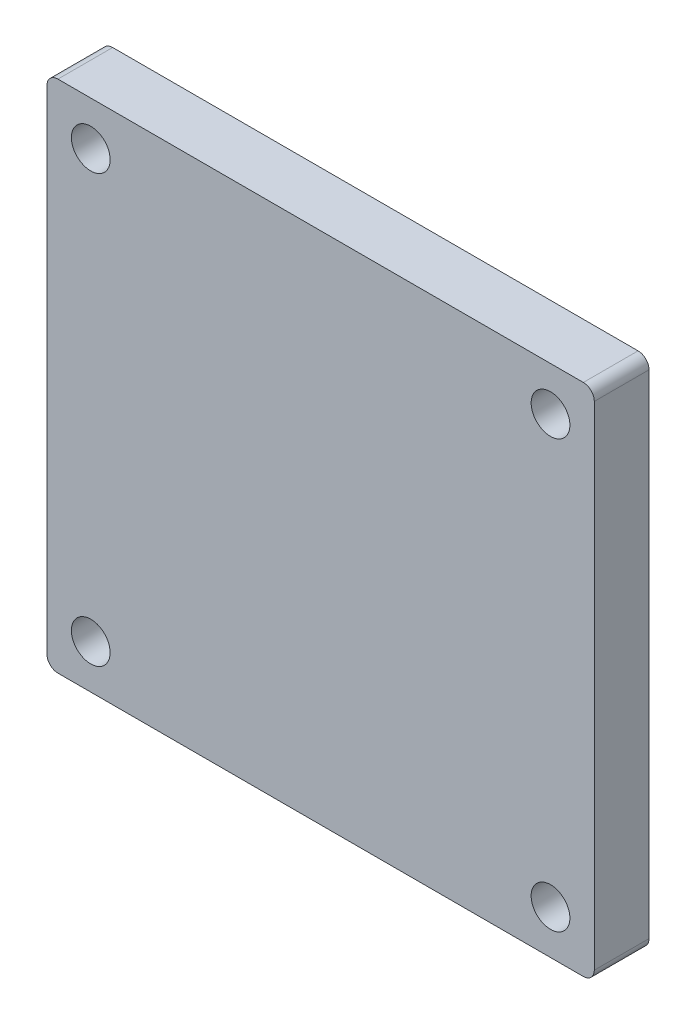
ISO-10303-21;
HEADER;
FILE_DESCRIPTION(('STEP AP214'),'2;1');
FILE_NAME('part.step','',(''),(''),'','','');
FILE_SCHEMA(('AUTOMOTIVE_DESIGN { 1 0 10303 214 1 1 1 1 }'));
ENDSEC;
DATA;
#1=APPLICATION_CONTEXT('core data for automotive mechanical design processes');
#2=APPLICATION_PROTOCOL_DEFINITION('international standard','automotive_design',2000,#1);
#3=PRODUCT_CONTEXT('',#1,'mechanical');
#4=PRODUCT('Part','Part','',(#3));
#5=PRODUCT_RELATED_PRODUCT_CATEGORY('part','',(#4));
#6=PRODUCT_DEFINITION_FORMATION('','',#4);
#7=PRODUCT_DEFINITION_CONTEXT('part definition',#1,'design');
#8=PRODUCT_DEFINITION('design','',#6,#7);
#9=PRODUCT_DEFINITION_SHAPE('','',#8);
#10=(LENGTH_UNIT() NAMED_UNIT(*) SI_UNIT(.MILLI.,.METRE.));
#11=(NAMED_UNIT(*) PLANE_ANGLE_UNIT() SI_UNIT($,.RADIAN.));
#12=(NAMED_UNIT(*) SI_UNIT($,.STERADIAN.) SOLID_ANGLE_UNIT());
#13=UNCERTAINTY_MEASURE_WITH_UNIT(LENGTH_MEASURE(1.E-05),#10,'distance_accuracy_value','');
#14=(GEOMETRIC_REPRESENTATION_CONTEXT(3) GLOBAL_UNCERTAINTY_ASSIGNED_CONTEXT((#13)) GLOBAL_UNIT_ASSIGNED_CONTEXT((#10,
#11,#12)) REPRESENTATION_CONTEXT('',''));
#15=CARTESIAN_POINT('',(0.,0.,0.));
#16=DIRECTION('',(0.,0.,1.));
#17=DIRECTION('',(1.,0.,0.));
#18=AXIS2_PLACEMENT_3D('',#15,#16,#17);
#19=CARTESIAN_POINT('',(0.,0.,6.35));
#20=DIRECTION('',(1.,0.,0.));
#21=DIRECTION('',(0.,0.,-1.));
#22=AXIS2_PLACEMENT_3D('',#19,#20,#21);
#23=PLANE('',#22);
#24=DIRECTION('',(0.,-1.,0.));
#25=VECTOR('',#24,1.);
#26=CARTESIAN_POINT('',(0.,0.,0.));
#27=LINE('',#26,#25);
#28=CARTESIAN_POINT('',(0.,58.42,0.));
#29=VERTEX_POINT('',#28);
#30=CARTESIAN_POINT('',(0.,1.27,0.));
#31=VERTEX_POINT('',#30);
#32=EDGE_CURVE('E130',#29,#31,#27,.T.);
#33=ORIENTED_EDGE('',*,*,#32,.T.);
#34=DIRECTION('',(0.,0.,-1.));
#35=VECTOR('',#34,1.);
#36=CARTESIAN_POINT('',(0.,1.27,6.35));
#37=LINE('',#36,#35);
#38=CARTESIAN_POINT('',(0.,1.27,6.35));
#39=VERTEX_POINT('',#38);
#40=EDGE_CURVE('E108',#31,#39,#37,.F.);
#41=ORIENTED_EDGE('',*,*,#40,.T.);
#42=DIRECTION('',(0.,-1.,0.));
#43=VECTOR('',#42,1.);
#44=CARTESIAN_POINT('',(0.,0.,6.35));
#45=LINE('',#44,#43);
#46=CARTESIAN_POINT('',(0.,58.42,6.35));
#47=VERTEX_POINT('',#46);
#48=EDGE_CURVE('E139',#47,#39,#45,.T.);
#49=ORIENTED_EDGE('',*,*,#48,.F.);
#50=DIRECTION('',(0.,0.,-1.));
#51=VECTOR('',#50,1.);
#52=CARTESIAN_POINT('',(0.,58.42,6.35));
#53=LINE('',#52,#51);
#54=EDGE_CURVE('E113',#47,#29,#53,.T.);
#55=ORIENTED_EDGE('',*,*,#54,.T.);
#56=EDGE_LOOP('',(#33,#41,#49,#55));
#57=FACE_BOUND('',#56,.T.);
#58=ADVANCED_FACE('F37',(#57),#23,.F.);
#59=CARTESIAN_POINT('',(0.,0.,6.35));
#60=DIRECTION('',(0.,1.,0.));
#61=DIRECTION('',(0.,0.,1.));
#62=AXIS2_PLACEMENT_3D('',#59,#60,#61);
#63=PLANE('',#62);
#64=DIRECTION('',(1.,0.,0.));
#65=VECTOR('',#64,1.);
#66=CARTESIAN_POINT('',(0.,0.,6.35));
#67=LINE('',#66,#65);
#68=CARTESIAN_POINT('',(1.27,0.,6.35));
#69=VERTEX_POINT('',#68);
#70=CARTESIAN_POINT('',(62.23,0.,6.35));
#71=VERTEX_POINT('',#70);
#72=EDGE_CURVE('E123',#69,#71,#67,.T.);
#73=ORIENTED_EDGE('',*,*,#72,.F.);
#74=DIRECTION('',(0.,0.,-1.));
#75=VECTOR('',#74,1.);
#76=CARTESIAN_POINT('',(1.27,0.,6.35));
#77=LINE('',#76,#75);
#78=CARTESIAN_POINT('',(1.27,0.,0.));
#79=VERTEX_POINT('',#78);
#80=EDGE_CURVE('E107',#69,#79,#77,.T.);
#81=ORIENTED_EDGE('',*,*,#80,.T.);
#82=DIRECTION('',(1.,0.,0.));
#83=VECTOR('',#82,1.);
#84=CARTESIAN_POINT('',(0.,0.,0.));
#85=LINE('',#84,#83);
#86=CARTESIAN_POINT('',(62.23,0.,0.));
#87=VERTEX_POINT('',#86);
#88=EDGE_CURVE('E120',#79,#87,#85,.T.);
#89=ORIENTED_EDGE('',*,*,#88,.T.);
#90=DIRECTION('',(0.,0.,-1.));
#91=VECTOR('',#90,1.);
#92=CARTESIAN_POINT('',(62.23,0.,6.35));
#93=LINE('',#92,#91);
#94=EDGE_CURVE('E125',#87,#71,#93,.F.);
#95=ORIENTED_EDGE('',*,*,#94,.T.);
#96=EDGE_LOOP('',(#73,#81,#89,#95));
#97=FACE_BOUND('',#96,.T.);
#98=ADVANCED_FACE('F119',(#97),#63,.F.);
#99=CARTESIAN_POINT('',(63.5,0.,6.35));
#100=DIRECTION('',(-1.,0.,0.));
#101=DIRECTION('',(0.,0.,1.));
#102=AXIS2_PLACEMENT_3D('',#99,#100,#101);
#103=PLANE('',#102);
#104=DIRECTION('',(0.,1.,0.));
#105=VECTOR('',#104,1.);
#106=CARTESIAN_POINT('',(63.5,0.,6.35));
#107=LINE('',#106,#105);
#108=CARTESIAN_POINT('',(63.5,1.27,6.35));
#109=VERTEX_POINT('',#108);
#110=CARTESIAN_POINT('',(63.5,58.42,6.35));
#111=VERTEX_POINT('',#110);
#112=EDGE_CURVE('E169',#109,#111,#107,.T.);
#113=ORIENTED_EDGE('',*,*,#112,.F.);
#114=DIRECTION('',(0.,0.,-1.));
#115=VECTOR('',#114,1.);
#116=CARTESIAN_POINT('',(63.5,1.27,6.35));
#117=LINE('',#116,#115);
#118=CARTESIAN_POINT('',(63.5,1.27,0.));
#119=VERTEX_POINT('',#118);
#120=EDGE_CURVE('E162',#109,#119,#117,.T.);
#121=ORIENTED_EDGE('',*,*,#120,.T.);
#122=DIRECTION('',(0.,1.,0.));
#123=VECTOR('',#122,1.);
#124=CARTESIAN_POINT('',(63.5,0.,0.));
#125=LINE('',#124,#123);
#126=CARTESIAN_POINT('',(63.5,58.42,0.));
#127=VERTEX_POINT('',#126);
#128=EDGE_CURVE('E129',#119,#127,#125,.T.);
#129=ORIENTED_EDGE('',*,*,#128,.T.);
#130=DIRECTION('',(0.,0.,-1.));
#131=VECTOR('',#130,1.);
#132=CARTESIAN_POINT('',(63.5,58.42,6.35));
#133=LINE('',#132,#131);
#134=EDGE_CURVE('E160',#127,#111,#133,.F.);
#135=ORIENTED_EDGE('',*,*,#134,.T.);
#136=EDGE_LOOP('',(#113,#121,#129,#135));
#137=FACE_BOUND('',#136,.T.);
#138=ADVANCED_FACE('F167',(#137),#103,.F.);
#139=CARTESIAN_POINT('',(0.,59.69,6.35));
#140=DIRECTION('',(0.,-1.,0.));
#141=DIRECTION('',(0.,0.,-1.));
#142=AXIS2_PLACEMENT_3D('',#139,#140,#141);
#143=PLANE('',#142);
#144=DIRECTION('',(-1.,0.,0.));
#145=VECTOR('',#144,1.);
#146=CARTESIAN_POINT('',(0.,59.69,6.35));
#147=LINE('',#146,#145);
#148=CARTESIAN_POINT('',(62.23,59.69,6.35));
#149=VERTEX_POINT('',#148);
#150=CARTESIAN_POINT('',(1.27,59.69,6.35));
#151=VERTEX_POINT('',#150);
#152=EDGE_CURVE('E140',#149,#151,#147,.T.);
#153=ORIENTED_EDGE('',*,*,#152,.F.);
#154=DIRECTION('',(0.,0.,-1.));
#155=VECTOR('',#154,1.);
#156=CARTESIAN_POINT('',(62.23,59.69,6.35));
#157=LINE('',#156,#155);
#158=CARTESIAN_POINT('',(62.23,59.69,0.));
#159=VERTEX_POINT('',#158);
#160=EDGE_CURVE('E12',#149,#159,#157,.T.);
#161=ORIENTED_EDGE('',*,*,#160,.T.);
#162=DIRECTION('',(-1.,0.,0.));
#163=VECTOR('',#162,1.);
#164=CARTESIAN_POINT('',(0.,59.69,0.));
#165=LINE('',#164,#163);
#166=CARTESIAN_POINT('',(1.27,59.69,0.));
#167=VERTEX_POINT('',#166);
#168=EDGE_CURVE('E133',#159,#167,#165,.T.);
#169=ORIENTED_EDGE('',*,*,#168,.T.);
#170=DIRECTION('',(0.,0.,-1.));
#171=VECTOR('',#170,1.);
#172=CARTESIAN_POINT('',(1.27,59.69,6.35));
#173=LINE('',#172,#171);
#174=EDGE_CURVE('E45',#167,#151,#173,.F.);
#175=ORIENTED_EDGE('',*,*,#174,.T.);
#176=EDGE_LOOP('',(#153,#161,#169,#175));
#177=FACE_BOUND('',#176,.T.);
#178=ADVANCED_FACE('F176',(#177),#143,.F.);
#179=CARTESIAN_POINT('',(0.,0.,6.35));
#180=DIRECTION('',(0.,0.,-1.));
#181=DIRECTION('',(-1.,0.,0.));
#182=AXIS2_PLACEMENT_3D('',#179,#180,#181);
#183=PLANE('',#182);
#184=CARTESIAN_POINT('',(5.08,54.61,6.35));
#185=DIRECTION('',(0.,0.,1.));
#186=DIRECTION('',(1.,0.,0.));
#187=AXIS2_PLACEMENT_3D('',#184,#185,#186);
#188=CIRCLE('',#187,2.24789999999999);
#189=CARTESIAN_POINT('',(7.32789999999999,54.61,6.35));
#190=VERTEX_POINT('',#189);
#191=EDGE_CURVE('E221',#190,#190,#188,.T.);
#192=ORIENTED_EDGE('',*,*,#191,.F.);
#193=EDGE_LOOP('',(#192));
#194=FACE_BOUND('',#193,.T.);
#195=CARTESIAN_POINT('',(58.42,54.61,6.35));
#196=DIRECTION('',(0.,0.,1.));
#197=DIRECTION('',(1.,0.,0.));
#198=AXIS2_PLACEMENT_3D('',#195,#196,#197);
#199=CIRCLE('',#198,2.24789999999998);
#200=CARTESIAN_POINT('',(60.6679,54.61,6.35));
#201=VERTEX_POINT('',#200);
#202=EDGE_CURVE('E214',#201,#201,#199,.T.);
#203=ORIENTED_EDGE('',*,*,#202,.F.);
#204=EDGE_LOOP('',(#203));
#205=FACE_BOUND('',#204,.T.);
#206=CARTESIAN_POINT('',(58.42,5.08,6.35));
#207=DIRECTION('',(0.,0.,1.));
#208=DIRECTION('',(1.,0.,0.));
#209=AXIS2_PLACEMENT_3D('',#206,#207,#208);
#210=CIRCLE('',#209,2.24789999999998);
#211=CARTESIAN_POINT('',(60.6679,5.08,6.35));
#212=VERTEX_POINT('',#211);
#213=EDGE_CURVE('E204',#212,#212,#210,.T.);
#214=ORIENTED_EDGE('',*,*,#213,.F.);
#215=EDGE_LOOP('',(#214));
#216=FACE_BOUND('',#215,.T.);
#217=CARTESIAN_POINT('',(5.08,5.08,6.35));
#218=DIRECTION('',(0.,0.,1.));
#219=DIRECTION('',(1.,0.,0.));
#220=AXIS2_PLACEMENT_3D('',#217,#218,#219);
#221=CIRCLE('',#220,2.24789999999999);
#222=CARTESIAN_POINT('',(7.32789999999999,5.08,6.35));
#223=VERTEX_POINT('',#222);
#224=EDGE_CURVE('E196',#223,#223,#221,.T.);
#225=ORIENTED_EDGE('',*,*,#224,.F.);
#226=EDGE_LOOP('',(#225));
#227=FACE_BOUND('',#226,.T.);
#228=ORIENTED_EDGE('',*,*,#48,.T.);
#229=CARTESIAN_POINT('',(1.27,1.27,6.35));
#230=DIRECTION('',(0.,0.,-1.));
#231=DIRECTION('',(-1.,0.,0.));
#232=AXIS2_PLACEMENT_3D('',#229,#230,#231);
#233=CIRCLE('',#232,1.27);
#234=EDGE_CURVE('E157',#39,#69,#233,.F.);
#235=ORIENTED_EDGE('',*,*,#234,.T.);
#236=ORIENTED_EDGE('',*,*,#72,.T.);
#237=CARTESIAN_POINT('',(62.23,1.27,6.35));
#238=DIRECTION('',(0.,0.,-1.));
#239=DIRECTION('',(-1.,0.,0.));
#240=AXIS2_PLACEMENT_3D('',#237,#238,#239);
#241=CIRCLE('',#240,1.27);
#242=EDGE_CURVE('E154',#71,#109,#241,.F.);
#243=ORIENTED_EDGE('',*,*,#242,.T.);
#244=ORIENTED_EDGE('',*,*,#112,.T.);
#245=CARTESIAN_POINT('',(62.23,58.42,6.35));
#246=DIRECTION('',(0.,0.,-1.));
#247=DIRECTION('',(-1.,0.,0.));
#248=AXIS2_PLACEMENT_3D('',#245,#246,#247);
#249=CIRCLE('',#248,1.27);
#250=EDGE_CURVE('E58',#111,#149,#249,.F.);
#251=ORIENTED_EDGE('',*,*,#250,.T.);
#252=ORIENTED_EDGE('',*,*,#152,.T.);
#253=CARTESIAN_POINT('',(1.27,58.42,6.35));
#254=DIRECTION('',(0.,0.,-1.));
#255=DIRECTION('',(-1.,0.,0.));
#256=AXIS2_PLACEMENT_3D('',#253,#254,#255);
#257=CIRCLE('',#256,1.27);
#258=EDGE_CURVE('E149',#151,#47,#257,.F.);
#259=ORIENTED_EDGE('',*,*,#258,.T.);
#260=EDGE_LOOP('',(#228,#235,#236,#243,#244,#251,#252,#259));
#261=FACE_BOUND('',#260,.T.);
#262=ADVANCED_FACE('F229',(#194,#205,#216,#227,#261),#183,.F.);
#263=CARTESIAN_POINT('',(0.,0.,0.));
#264=DIRECTION('',(0.,0.,-1.));
#265=DIRECTION('',(-1.,0.,0.));
#266=AXIS2_PLACEMENT_3D('',#263,#264,#265);
#267=PLANE('',#266);
#268=CARTESIAN_POINT('',(5.08,54.61,0.));
#269=DIRECTION('',(0.,0.,1.));
#270=DIRECTION('',(1.,0.,0.));
#271=AXIS2_PLACEMENT_3D('',#268,#269,#270);
#272=CIRCLE('',#271,2.2479);
#273=CARTESIAN_POINT('',(7.3279,54.61,0.));
#274=VERTEX_POINT('',#273);
#275=EDGE_CURVE('E219',#274,#274,#272,.T.);
#276=ORIENTED_EDGE('',*,*,#275,.T.);
#277=EDGE_LOOP('',(#276));
#278=FACE_BOUND('',#277,.T.);
#279=CARTESIAN_POINT('',(58.42,54.61,0.));
#280=DIRECTION('',(0.,0.,1.));
#281=DIRECTION('',(1.,0.,0.));
#282=AXIS2_PLACEMENT_3D('',#279,#280,#281);
#283=CIRCLE('',#282,2.2479);
#284=CARTESIAN_POINT('',(60.6679,54.61,0.));
#285=VERTEX_POINT('',#284);
#286=EDGE_CURVE('E209',#285,#285,#283,.T.);
#287=ORIENTED_EDGE('',*,*,#286,.T.);
#288=EDGE_LOOP('',(#287));
#289=FACE_BOUND('',#288,.T.);
#290=CARTESIAN_POINT('',(58.42,5.08,0.));
#291=DIRECTION('',(0.,0.,1.));
#292=DIRECTION('',(1.,0.,0.));
#293=AXIS2_PLACEMENT_3D('',#290,#291,#292);
#294=CIRCLE('',#293,2.2479);
#295=CARTESIAN_POINT('',(60.6679,5.08,0.));
#296=VERTEX_POINT('',#295);
#297=EDGE_CURVE('E201',#296,#296,#294,.T.);
#298=ORIENTED_EDGE('',*,*,#297,.T.);
#299=EDGE_LOOP('',(#298));
#300=FACE_BOUND('',#299,.T.);
#301=CARTESIAN_POINT('',(5.08,5.08,0.));
#302=DIRECTION('',(0.,0.,1.));
#303=DIRECTION('',(1.,0.,0.));
#304=AXIS2_PLACEMENT_3D('',#301,#302,#303);
#305=CIRCLE('',#304,2.2479);
#306=CARTESIAN_POINT('',(7.3279,5.08,0.));
#307=VERTEX_POINT('',#306);
#308=EDGE_CURVE('E135',#307,#307,#305,.T.);
#309=ORIENTED_EDGE('',*,*,#308,.T.);
#310=EDGE_LOOP('',(#309));
#311=FACE_BOUND('',#310,.T.);
#312=ORIENTED_EDGE('',*,*,#88,.F.);
#313=CARTESIAN_POINT('',(1.27,1.27,0.));
#314=DIRECTION('',(0.,0.,-1.));
#315=DIRECTION('',(-1.,0.,0.));
#316=AXIS2_PLACEMENT_3D('',#313,#314,#315);
#317=CIRCLE('',#316,1.27);
#318=EDGE_CURVE('E103',#79,#31,#317,.T.);
#319=ORIENTED_EDGE('',*,*,#318,.T.);
#320=ORIENTED_EDGE('',*,*,#32,.F.);
#321=CARTESIAN_POINT('',(1.27,58.42,0.));
#322=DIRECTION('',(0.,0.,-1.));
#323=DIRECTION('',(-1.,0.,0.));
#324=AXIS2_PLACEMENT_3D('',#321,#322,#323);
#325=CIRCLE('',#324,1.27);
#326=EDGE_CURVE('E124',#29,#167,#325,.T.);
#327=ORIENTED_EDGE('',*,*,#326,.T.);
#328=ORIENTED_EDGE('',*,*,#168,.F.);
#329=CARTESIAN_POINT('',(62.23,58.42,0.));
#330=DIRECTION('',(0.,0.,-1.));
#331=DIRECTION('',(-1.,0.,0.));
#332=AXIS2_PLACEMENT_3D('',#329,#330,#331);
#333=CIRCLE('',#332,1.27);
#334=EDGE_CURVE('E143',#159,#127,#333,.T.);
#335=ORIENTED_EDGE('',*,*,#334,.T.);
#336=ORIENTED_EDGE('',*,*,#128,.F.);
#337=CARTESIAN_POINT('',(62.23,1.27,0.));
#338=DIRECTION('',(0.,0.,-1.));
#339=DIRECTION('',(-1.,0.,0.));
#340=AXIS2_PLACEMENT_3D('',#337,#338,#339);
#341=CIRCLE('',#340,1.27);
#342=EDGE_CURVE('E114',#119,#87,#341,.T.);
#343=ORIENTED_EDGE('',*,*,#342,.T.);
#344=EDGE_LOOP('',(#312,#319,#320,#327,#328,#335,#336,#343));
#345=FACE_BOUND('',#344,.T.);
#346=ADVANCED_FACE('F127',(#278,#289,#300,#311,#345),#267,.T.);
#347=CARTESIAN_POINT('',(1.27,1.27,6.35));
#348=DIRECTION('',(0.,0.,-1.));
#349=DIRECTION('',(-1.,0.,0.));
#350=AXIS2_PLACEMENT_3D('',#347,#348,#349);
#351=CYLINDRICAL_SURFACE('',#350,1.27);
#352=ORIENTED_EDGE('',*,*,#234,.F.);
#353=ORIENTED_EDGE('',*,*,#40,.F.);
#354=ORIENTED_EDGE('',*,*,#318,.F.);
#355=ORIENTED_EDGE('',*,*,#80,.F.);
#356=EDGE_LOOP('',(#352,#353,#354,#355));
#357=FACE_BOUND('',#356,.T.);
#358=ADVANCED_FACE('F106',(#357),#351,.T.);
#359=CARTESIAN_POINT('',(62.23,1.27,6.35));
#360=DIRECTION('',(0.,0.,-1.));
#361=DIRECTION('',(-1.,0.,0.));
#362=AXIS2_PLACEMENT_3D('',#359,#360,#361);
#363=CYLINDRICAL_SURFACE('',#362,1.27);
#364=ORIENTED_EDGE('',*,*,#242,.F.);
#365=ORIENTED_EDGE('',*,*,#94,.F.);
#366=ORIENTED_EDGE('',*,*,#342,.F.);
#367=ORIENTED_EDGE('',*,*,#120,.F.);
#368=EDGE_LOOP('',(#364,#365,#366,#367));
#369=FACE_BOUND('',#368,.T.);
#370=ADVANCED_FACE('F251',(#369),#363,.T.);
#371=CARTESIAN_POINT('',(62.23,58.42,6.35));
#372=DIRECTION('',(0.,0.,-1.));
#373=DIRECTION('',(-1.,0.,0.));
#374=AXIS2_PLACEMENT_3D('',#371,#372,#373);
#375=CYLINDRICAL_SURFACE('',#374,1.27);
#376=ORIENTED_EDGE('',*,*,#250,.F.);
#377=ORIENTED_EDGE('',*,*,#134,.F.);
#378=ORIENTED_EDGE('',*,*,#334,.F.);
#379=ORIENTED_EDGE('',*,*,#160,.F.);
#380=EDGE_LOOP('',(#376,#377,#378,#379));
#381=FACE_BOUND('',#380,.T.);
#382=ADVANCED_FACE('F175',(#381),#375,.T.);
#383=CARTESIAN_POINT('',(1.27,58.42,6.35));
#384=DIRECTION('',(0.,0.,-1.));
#385=DIRECTION('',(-1.,0.,0.));
#386=AXIS2_PLACEMENT_3D('',#383,#384,#385);
#387=CYLINDRICAL_SURFACE('',#386,1.27);
#388=ORIENTED_EDGE('',*,*,#258,.F.);
#389=ORIENTED_EDGE('',*,*,#174,.F.);
#390=ORIENTED_EDGE('',*,*,#326,.F.);
#391=ORIENTED_EDGE('',*,*,#54,.F.);
#392=EDGE_LOOP('',(#388,#389,#390,#391));
#393=FACE_BOUND('',#392,.T.);
#394=ADVANCED_FACE('F39',(#393),#387,.T.);
#395=CARTESIAN_POINT('',(5.08,5.08,6.35));
#396=DIRECTION('',(0.,0.,1.));
#397=DIRECTION('',(1.,0.,0.));
#398=AXIS2_PLACEMENT_3D('',#395,#396,#397);
#399=CYLINDRICAL_SURFACE('',#398,2.24789999999999);
#400=ORIENTED_EDGE('',*,*,#308,.F.);
#401=EDGE_LOOP('',(#400));
#402=FACE_BOUND('',#401,.T.);
#403=ORIENTED_EDGE('',*,*,#224,.T.);
#404=EDGE_LOOP('',(#403));
#405=FACE_BOUND('',#404,.T.);
#406=ADVANCED_FACE('F243',(#402,#405),#399,.F.);
#407=CARTESIAN_POINT('',(58.42,5.08,6.35));
#408=DIRECTION('',(0.,0.,1.));
#409=DIRECTION('',(1.,0.,0.));
#410=AXIS2_PLACEMENT_3D('',#407,#408,#409);
#411=CYLINDRICAL_SURFACE('',#410,2.24789999999999);
#412=ORIENTED_EDGE('',*,*,#297,.F.);
#413=EDGE_LOOP('',(#412));
#414=FACE_BOUND('',#413,.T.);
#415=ORIENTED_EDGE('',*,*,#213,.T.);
#416=EDGE_LOOP('',(#415));
#417=FACE_BOUND('',#416,.T.);
#418=ADVANCED_FACE('F248',(#414,#417),#411,.F.);
#419=CARTESIAN_POINT('',(58.42,54.61,6.35));
#420=DIRECTION('',(0.,0.,1.));
#421=DIRECTION('',(1.,0.,0.));
#422=AXIS2_PLACEMENT_3D('',#419,#420,#421);
#423=CYLINDRICAL_SURFACE('',#422,2.24789999999999);
#424=ORIENTED_EDGE('',*,*,#286,.F.);
#425=EDGE_LOOP('',(#424));
#426=FACE_BOUND('',#425,.T.);
#427=ORIENTED_EDGE('',*,*,#202,.T.);
#428=EDGE_LOOP('',(#427));
#429=FACE_BOUND('',#428,.T.);
#430=ADVANCED_FACE('F309',(#426,#429),#423,.F.);
#431=CARTESIAN_POINT('',(5.08,54.61,6.35));
#432=DIRECTION('',(0.,0.,1.));
#433=DIRECTION('',(1.,0.,0.));
#434=AXIS2_PLACEMENT_3D('',#431,#432,#433);
#435=CYLINDRICAL_SURFACE('',#434,2.24789999999999);
#436=ORIENTED_EDGE('',*,*,#275,.F.);
#437=EDGE_LOOP('',(#436));
#438=FACE_BOUND('',#437,.T.);
#439=ORIENTED_EDGE('',*,*,#191,.T.);
#440=EDGE_LOOP('',(#439));
#441=FACE_BOUND('',#440,.T.);
#442=ADVANCED_FACE('F227',(#438,#441),#435,.F.);
#443=CLOSED_SHELL('',(#58,#98,#138,#178,#262,#346,#358,#370,#382,#394,#406,#418,#430,#442));
#444=MANIFOLD_SOLID_BREP('B2',#443);
#445=ADVANCED_BREP_SHAPE_REPRESENTATION('',(#18,#444),#14);
#446=SHAPE_DEFINITION_REPRESENTATION(#9,#445);
ENDSEC;
END-ISO-10303-21;
